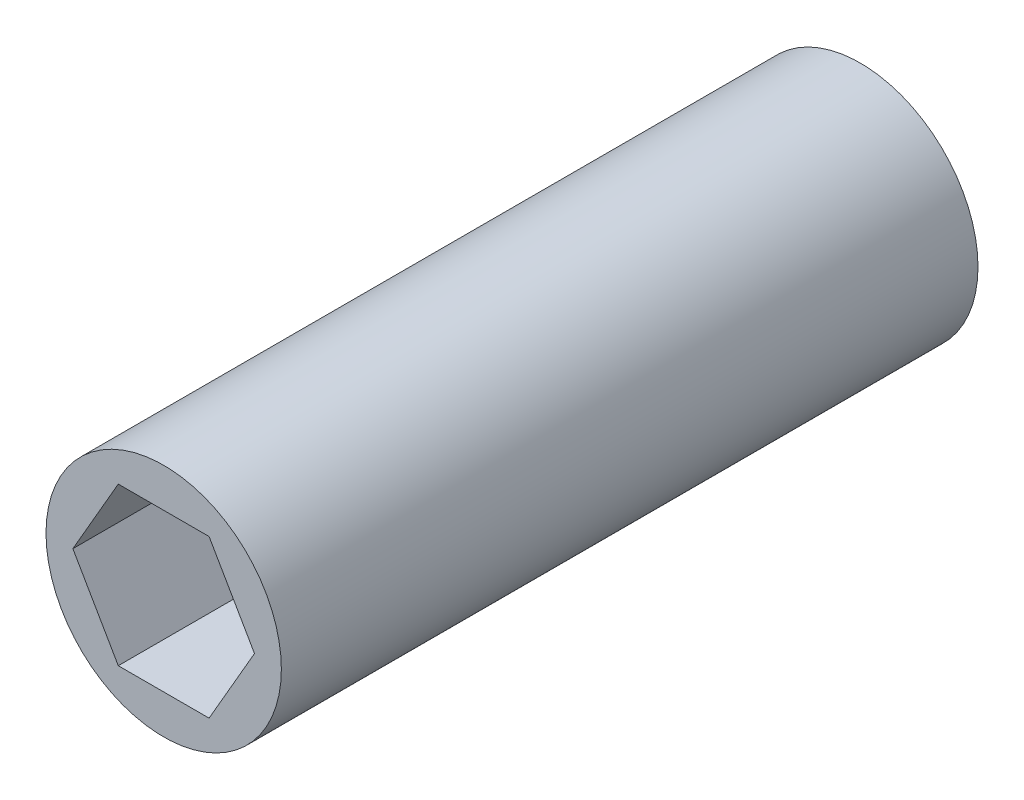
ISO-10303-21;
HEADER;
FILE_DESCRIPTION(('STEP AP214'),'2;1');
FILE_NAME('part.step','',(''),(''),'','','');
FILE_SCHEMA(('AUTOMOTIVE_DESIGN { 1 0 10303 214 1 1 1 1 }'));
ENDSEC;
DATA;
#1=APPLICATION_CONTEXT('core data for automotive mechanical design processes');
#2=APPLICATION_PROTOCOL_DEFINITION('international standard','automotive_design',2000,#1);
#3=PRODUCT_CONTEXT('',#1,'mechanical');
#4=PRODUCT('Part','Part','',(#3));
#5=PRODUCT_RELATED_PRODUCT_CATEGORY('part','',(#4));
#6=PRODUCT_DEFINITION_FORMATION('','',#4);
#7=PRODUCT_DEFINITION_CONTEXT('part definition',#1,'design');
#8=PRODUCT_DEFINITION('design','',#6,#7);
#9=PRODUCT_DEFINITION_SHAPE('','',#8);
#10=(LENGTH_UNIT() NAMED_UNIT(*) SI_UNIT(.MILLI.,.METRE.));
#11=(NAMED_UNIT(*) PLANE_ANGLE_UNIT() SI_UNIT($,.RADIAN.));
#12=(NAMED_UNIT(*) SI_UNIT($,.STERADIAN.) SOLID_ANGLE_UNIT());
#13=UNCERTAINTY_MEASURE_WITH_UNIT(LENGTH_MEASURE(1.E-05),#10,'distance_accuracy_value','');
#14=(GEOMETRIC_REPRESENTATION_CONTEXT(3) GLOBAL_UNCERTAINTY_ASSIGNED_CONTEXT((#13)) GLOBAL_UNIT_ASSIGNED_CONTEXT((#10,
#11,#12)) REPRESENTATION_CONTEXT('',''));
#15=CARTESIAN_POINT('',(0.,0.,0.));
#16=DIRECTION('',(0.,0.,1.));
#17=DIRECTION('',(1.,0.,0.));
#18=AXIS2_PLACEMENT_3D('',#15,#16,#17);
#19=CARTESIAN_POINT('',(0.,0.,22.2));
#20=DIRECTION('',(0.,0.,1.));
#21=DIRECTION('',(1.,0.,0.));
#22=AXIS2_PLACEMENT_3D('',#19,#20,#21);
#23=PLANE('',#22);
#24=CARTESIAN_POINT('',(0.,0.,22.2));
#25=DIRECTION('',(0.,0.,1.));
#26=DIRECTION('',(1.,0.,0.));
#27=AXIS2_PLACEMENT_3D('',#24,#25,#26);
#28=CIRCLE('',#27,7.5);
#29=CARTESIAN_POINT('',(7.5,0.,22.2));
#30=VERTEX_POINT('',#29);
#31=EDGE_CURVE('E11',#30,#30,#28,.T.);
#32=ORIENTED_EDGE('',*,*,#31,.T.);
#33=EDGE_LOOP('',(#32));
#34=FACE_BOUND('',#33,.T.);
#35=DIRECTION('',(-0.5,0.866025403784438,0.));
#36=VECTOR('',#35,1.);
#37=CARTESIAN_POINT('',(5.787936448626,0.,22.2));
#38=LINE('',#37,#36);
#39=CARTESIAN_POINT('',(5.787936448626,0.,22.2));
#40=VERTEX_POINT('',#39);
#41=CARTESIAN_POINT('',(2.893968224313,5.0125,22.2));
#42=VERTEX_POINT('',#41);
#43=EDGE_CURVE('E100',#40,#42,#38,.T.);
#44=ORIENTED_EDGE('',*,*,#43,.F.);
#45=DIRECTION('',(0.5,0.866025403784438,0.));
#46=VECTOR('',#45,1.);
#47=CARTESIAN_POINT('',(2.893968224313,-5.0125,22.2));
#48=LINE('',#47,#46);
#49=CARTESIAN_POINT('',(2.893968224313,-5.0125,22.2));
#50=VERTEX_POINT('',#49);
#51=EDGE_CURVE('E92',#50,#40,#48,.T.);
#52=ORIENTED_EDGE('',*,*,#51,.F.);
#53=DIRECTION('',(1.,0.,0.));
#54=VECTOR('',#53,1.);
#55=CARTESIAN_POINT('',(-2.893968224313,-5.0125,22.2));
#56=LINE('',#55,#54);
#57=CARTESIAN_POINT('',(-2.893968224313,-5.0125,22.2));
#58=VERTEX_POINT('',#57);
#59=EDGE_CURVE('E120',#58,#50,#56,.T.);
#60=ORIENTED_EDGE('',*,*,#59,.F.);
#61=DIRECTION('',(0.5,-0.866025403784439,0.));
#62=VECTOR('',#61,1.);
#63=CARTESIAN_POINT('',(-5.787936448626,0.,22.2));
#64=LINE('',#63,#62);
#65=CARTESIAN_POINT('',(-5.787936448626,0.,22.2));
#66=VERTEX_POINT('',#65);
#67=EDGE_CURVE('E118',#66,#58,#64,.T.);
#68=ORIENTED_EDGE('',*,*,#67,.F.);
#69=DIRECTION('',(-0.5,-0.866025403784438,0.));
#70=VECTOR('',#69,1.);
#71=CARTESIAN_POINT('',(-2.893968224313,5.0125,22.2));
#72=LINE('',#71,#70);
#73=CARTESIAN_POINT('',(-2.893968224313,5.0125,22.2));
#74=VERTEX_POINT('',#73);
#75=EDGE_CURVE('E114',#74,#66,#72,.T.);
#76=ORIENTED_EDGE('',*,*,#75,.F.);
#77=DIRECTION('',(-1.,0.,0.));
#78=VECTOR('',#77,1.);
#79=CARTESIAN_POINT('',(2.893968224313,5.0125,22.2));
#80=LINE('',#79,#78);
#81=EDGE_CURVE('E112',#42,#74,#80,.T.);
#82=ORIENTED_EDGE('',*,*,#81,.F.);
#83=EDGE_LOOP('',(#44,#52,#60,#68,#76,#82));
#84=FACE_BOUND('',#83,.T.);
#85=ADVANCED_FACE('F39',(#34,#84),#23,.T.);
#86=CARTESIAN_POINT('',(0.,0.,-22.2));
#87=DIRECTION('',(0.,0.,1.));
#88=DIRECTION('',(1.,0.,0.));
#89=AXIS2_PLACEMENT_3D('',#86,#87,#88);
#90=PLANE('',#89);
#91=CARTESIAN_POINT('',(0.,0.,-22.2));
#92=DIRECTION('',(0.,0.,1.));
#93=DIRECTION('',(1.,0.,0.));
#94=AXIS2_PLACEMENT_3D('',#91,#92,#93);
#95=CIRCLE('',#94,7.5);
#96=CARTESIAN_POINT('',(7.5,0.,-22.2));
#97=VERTEX_POINT('',#96);
#98=EDGE_CURVE('E43',#97,#97,#95,.T.);
#99=ORIENTED_EDGE('',*,*,#98,.F.);
#100=EDGE_LOOP('',(#99));
#101=FACE_BOUND('',#100,.T.);
#102=DIRECTION('',(0.5,0.866025403784438,0.));
#103=VECTOR('',#102,1.);
#104=CARTESIAN_POINT('',(2.893968224313,-5.0125,-22.2));
#105=LINE('',#104,#103);
#106=CARTESIAN_POINT('',(2.893968224313,-5.0125,-22.2));
#107=VERTEX_POINT('',#106);
#108=CARTESIAN_POINT('',(5.787936448626,0.,-22.2));
#109=VERTEX_POINT('',#108);
#110=EDGE_CURVE('E62',#107,#109,#105,.T.);
#111=ORIENTED_EDGE('',*,*,#110,.T.);
#112=DIRECTION('',(-0.5,0.866025403784438,0.));
#113=VECTOR('',#112,1.);
#114=CARTESIAN_POINT('',(5.787936448626,0.,-22.2));
#115=LINE('',#114,#113);
#116=CARTESIAN_POINT('',(2.893968224313,5.0125,-22.2));
#117=VERTEX_POINT('',#116);
#118=EDGE_CURVE('E107',#109,#117,#115,.T.);
#119=ORIENTED_EDGE('',*,*,#118,.T.);
#120=DIRECTION('',(-1.,0.,0.));
#121=VECTOR('',#120,1.);
#122=CARTESIAN_POINT('',(2.893968224313,5.0125,-22.2));
#123=LINE('',#122,#121);
#124=CARTESIAN_POINT('',(-2.893968224313,5.0125,-22.2));
#125=VERTEX_POINT('',#124);
#126=EDGE_CURVE('E124',#117,#125,#123,.T.);
#127=ORIENTED_EDGE('',*,*,#126,.T.);
#128=DIRECTION('',(-0.5,-0.866025403784438,0.));
#129=VECTOR('',#128,1.);
#130=CARTESIAN_POINT('',(-2.893968224313,5.0125,-22.2));
#131=LINE('',#130,#129);
#132=CARTESIAN_POINT('',(-5.787936448626,0.,-22.2));
#133=VERTEX_POINT('',#132);
#134=EDGE_CURVE('E127',#125,#133,#131,.T.);
#135=ORIENTED_EDGE('',*,*,#134,.T.);
#136=DIRECTION('',(0.5,-0.866025403784439,0.));
#137=VECTOR('',#136,1.);
#138=CARTESIAN_POINT('',(-5.787936448626,0.,-22.2));
#139=LINE('',#138,#137);
#140=CARTESIAN_POINT('',(-2.893968224313,-5.0125,-22.2));
#141=VERTEX_POINT('',#140);
#142=EDGE_CURVE('E130',#133,#141,#139,.T.);
#143=ORIENTED_EDGE('',*,*,#142,.T.);
#144=DIRECTION('',(1.,0.,0.));
#145=VECTOR('',#144,1.);
#146=CARTESIAN_POINT('',(-2.893968224313,-5.0125,-22.2));
#147=LINE('',#146,#145);
#148=EDGE_CURVE('E101',#141,#107,#147,.T.);
#149=ORIENTED_EDGE('',*,*,#148,.T.);
#150=EDGE_LOOP('',(#111,#119,#127,#135,#143,#149));
#151=FACE_BOUND('',#150,.T.);
#152=ADVANCED_FACE('F147',(#101,#151),#90,.F.);
#153=CARTESIAN_POINT('',(0.,0.,22.2));
#154=DIRECTION('',(0.,0.,-1.));
#155=DIRECTION('',(-1.,0.,0.));
#156=AXIS2_PLACEMENT_3D('',#153,#154,#155);
#157=CYLINDRICAL_SURFACE('',#156,7.5);
#158=ORIENTED_EDGE('',*,*,#31,.F.);
#159=EDGE_LOOP('',(#158));
#160=FACE_BOUND('',#159,.T.);
#161=ORIENTED_EDGE('',*,*,#98,.T.);
#162=EDGE_LOOP('',(#161));
#163=FACE_BOUND('',#162,.T.);
#164=ADVANCED_FACE('F41',(#160,#163),#157,.T.);
#165=CARTESIAN_POINT('',(2.893968224313,-5.0125,22.2));
#166=DIRECTION('',(-0.866025403784439,0.5,0.));
#167=DIRECTION('',(-0.5,-0.866025403784439,0.));
#168=AXIS2_PLACEMENT_3D('',#165,#166,#167);
#169=PLANE('',#168);
#170=ORIENTED_EDGE('',*,*,#110,.F.);
#171=DIRECTION('',(0.,0.,-1.));
#172=VECTOR('',#171,1.);
#173=CARTESIAN_POINT('',(2.893968224313,-5.0125,22.2));
#174=LINE('',#173,#172);
#175=EDGE_CURVE('E96',#50,#107,#174,.T.);
#176=ORIENTED_EDGE('',*,*,#175,.F.);
#177=ORIENTED_EDGE('',*,*,#51,.T.);
#178=DIRECTION('',(0.,0.,-1.));
#179=VECTOR('',#178,1.);
#180=CARTESIAN_POINT('',(5.787936448626,0.,22.2));
#181=LINE('',#180,#179);
#182=EDGE_CURVE('E95',#40,#109,#181,.T.);
#183=ORIENTED_EDGE('',*,*,#182,.T.);
#184=EDGE_LOOP('',(#170,#176,#177,#183));
#185=FACE_BOUND('',#184,.T.);
#186=ADVANCED_FACE('F94',(#185),#169,.T.);
#187=CARTESIAN_POINT('',(5.787936448626,0.,22.2));
#188=DIRECTION('',(-0.866025403784438,-0.5,0.));
#189=DIRECTION('',(0.5,-0.866025403784439,0.));
#190=AXIS2_PLACEMENT_3D('',#187,#188,#189);
#191=PLANE('',#190);
#192=ORIENTED_EDGE('',*,*,#118,.F.);
#193=ORIENTED_EDGE('',*,*,#182,.F.);
#194=ORIENTED_EDGE('',*,*,#43,.T.);
#195=DIRECTION('',(0.,0.,-1.));
#196=VECTOR('',#195,1.);
#197=CARTESIAN_POINT('',(2.893968224313,5.0125,22.2));
#198=LINE('',#197,#196);
#199=EDGE_CURVE('E108',#42,#117,#198,.T.);
#200=ORIENTED_EDGE('',*,*,#199,.T.);
#201=EDGE_LOOP('',(#192,#193,#194,#200));
#202=FACE_BOUND('',#201,.T.);
#203=ADVANCED_FACE('F104',(#202),#191,.T.);
#204=CARTESIAN_POINT('',(2.893968224313,5.0125,22.2));
#205=DIRECTION('',(0.,-1.,0.));
#206=DIRECTION('',(1.,0.,0.));
#207=AXIS2_PLACEMENT_3D('',#204,#205,#206);
#208=PLANE('',#207);
#209=ORIENTED_EDGE('',*,*,#126,.F.);
#210=ORIENTED_EDGE('',*,*,#199,.F.);
#211=ORIENTED_EDGE('',*,*,#81,.T.);
#212=DIRECTION('',(0.,0.,-1.));
#213=VECTOR('',#212,1.);
#214=CARTESIAN_POINT('',(-2.893968224313,5.0125,22.2));
#215=LINE('',#214,#213);
#216=EDGE_CURVE('E139',#74,#125,#215,.T.);
#217=ORIENTED_EDGE('',*,*,#216,.T.);
#218=EDGE_LOOP('',(#209,#210,#211,#217));
#219=FACE_BOUND('',#218,.T.);
#220=ADVANCED_FACE('F143',(#219),#208,.T.);
#221=CARTESIAN_POINT('',(-2.893968224313,5.0125,22.2));
#222=DIRECTION('',(0.866025403784439,-0.5,0.));
#223=DIRECTION('',(0.5,0.866025403784439,0.));
#224=AXIS2_PLACEMENT_3D('',#221,#222,#223);
#225=PLANE('',#224);
#226=ORIENTED_EDGE('',*,*,#134,.F.);
#227=ORIENTED_EDGE('',*,*,#216,.F.);
#228=ORIENTED_EDGE('',*,*,#75,.T.);
#229=DIRECTION('',(0.,0.,-1.));
#230=VECTOR('',#229,1.);
#231=CARTESIAN_POINT('',(-5.787936448626,0.,22.2));
#232=LINE('',#231,#230);
#233=EDGE_CURVE('E137',#66,#133,#232,.T.);
#234=ORIENTED_EDGE('',*,*,#233,.T.);
#235=EDGE_LOOP('',(#226,#227,#228,#234));
#236=FACE_BOUND('',#235,.T.);
#237=ADVANCED_FACE('F155',(#236),#225,.T.);
#238=CARTESIAN_POINT('',(-5.787936448626,0.,22.2));
#239=DIRECTION('',(0.866025403784439,0.5,0.));
#240=DIRECTION('',(-0.5,0.866025403784439,0.));
#241=AXIS2_PLACEMENT_3D('',#238,#239,#240);
#242=PLANE('',#241);
#243=ORIENTED_EDGE('',*,*,#142,.F.);
#244=ORIENTED_EDGE('',*,*,#233,.F.);
#245=ORIENTED_EDGE('',*,*,#67,.T.);
#246=DIRECTION('',(0.,0.,-1.));
#247=VECTOR('',#246,1.);
#248=CARTESIAN_POINT('',(-2.893968224313,-5.0125,22.2));
#249=LINE('',#248,#247);
#250=EDGE_CURVE('E54',#58,#141,#249,.T.);
#251=ORIENTED_EDGE('',*,*,#250,.T.);
#252=EDGE_LOOP('',(#243,#244,#245,#251));
#253=FACE_BOUND('',#252,.T.);
#254=ADVANCED_FACE('F153',(#253),#242,.T.);
#255=CARTESIAN_POINT('',(-2.893968224313,-5.0125,22.2));
#256=DIRECTION('',(0.,1.,0.));
#257=DIRECTION('',(-1.,0.,0.));
#258=AXIS2_PLACEMENT_3D('',#255,#256,#257);
#259=PLANE('',#258);
#260=ORIENTED_EDGE('',*,*,#148,.F.);
#261=ORIENTED_EDGE('',*,*,#250,.F.);
#262=ORIENTED_EDGE('',*,*,#59,.T.);
#263=ORIENTED_EDGE('',*,*,#175,.T.);
#264=EDGE_LOOP('',(#260,#261,#262,#263));
#265=FACE_BOUND('',#264,.T.);
#266=ADVANCED_FACE('F149',(#265),#259,.T.);
#267=CLOSED_SHELL('',(#85,#152,#164,#186,#203,#220,#237,#254,#266));
#268=MANIFOLD_SOLID_BREP('B2',#267);
#269=ADVANCED_BREP_SHAPE_REPRESENTATION('',(#18,#268),#14);
#270=SHAPE_DEFINITION_REPRESENTATION(#9,#269);
ENDSEC;
END-ISO-10303-21;
